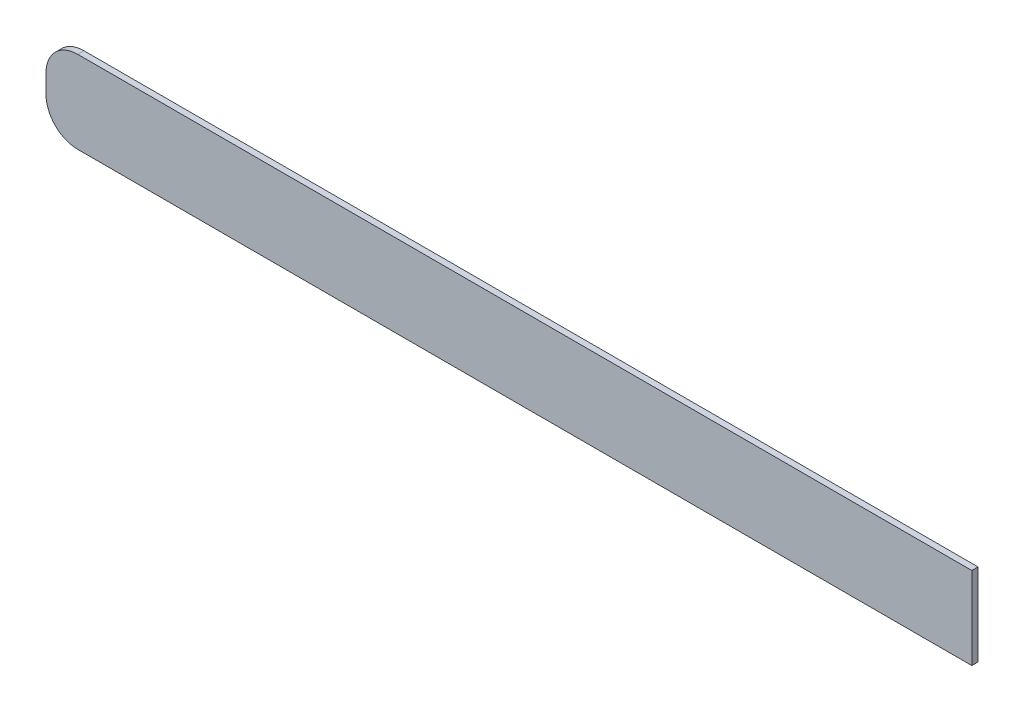
ISO-10303-21;
HEADER;
FILE_DESCRIPTION(('STEP AP214'),'2;1');
FILE_NAME('part.step','',(''),(''),'','','');
FILE_SCHEMA(('AUTOMOTIVE_DESIGN { 1 0 10303 214 1 1 1 1 }'));
ENDSEC;
DATA;
#1=APPLICATION_CONTEXT('core data for automotive mechanical design processes');
#2=APPLICATION_PROTOCOL_DEFINITION('international standard','automotive_design',2000,#1);
#3=PRODUCT_CONTEXT('',#1,'mechanical');
#4=PRODUCT('Part','Part','',(#3));
#5=PRODUCT_RELATED_PRODUCT_CATEGORY('part','',(#4));
#6=PRODUCT_DEFINITION_FORMATION('','',#4);
#7=PRODUCT_DEFINITION_CONTEXT('part definition',#1,'design');
#8=PRODUCT_DEFINITION('design','',#6,#7);
#9=PRODUCT_DEFINITION_SHAPE('','',#8);
#10=(LENGTH_UNIT() NAMED_UNIT(*) SI_UNIT(.MILLI.,.METRE.));
#11=(NAMED_UNIT(*) PLANE_ANGLE_UNIT() SI_UNIT($,.RADIAN.));
#12=(NAMED_UNIT(*) SI_UNIT($,.STERADIAN.) SOLID_ANGLE_UNIT());
#13=UNCERTAINTY_MEASURE_WITH_UNIT(LENGTH_MEASURE(1.E-05),#10,'distance_accuracy_value','');
#14=(GEOMETRIC_REPRESENTATION_CONTEXT(3) GLOBAL_UNCERTAINTY_ASSIGNED_CONTEXT((#13)) GLOBAL_UNIT_ASSIGNED_CONTEXT((#10,
#11,#12)) REPRESENTATION_CONTEXT('',''));
#15=CARTESIAN_POINT('',(0.,0.,0.));
#16=DIRECTION('',(0.,0.,1.));
#17=DIRECTION('',(1.,0.,0.));
#18=AXIS2_PLACEMENT_3D('',#15,#16,#17);
#19=CARTESIAN_POINT('',(36.9824,-3.28929999999999,0.4953));
#20=DIRECTION('',(-1.,0.,0.));
#21=DIRECTION('',(0.,0.,1.));
#22=AXIS2_PLACEMENT_3D('',#19,#20,#21);
#23=PLANE('',#22);
#24=DIRECTION('',(0.,1.,0.));
#25=VECTOR('',#24,1.);
#26=CARTESIAN_POINT('',(36.9824,-3.28929999999999,0.));
#27=LINE('',#26,#25);
#28=CARTESIAN_POINT('',(36.9824,-3.28929999999999,0.));
#29=VERTEX_POINT('',#28);
#30=CARTESIAN_POINT('',(36.9824,3.28930000000001,0.));
#31=VERTEX_POINT('',#30);
#32=EDGE_CURVE('E117',#29,#31,#27,.T.);
#33=ORIENTED_EDGE('',*,*,#32,.T.);
#34=DIRECTION('',(0.,0.,-1.));
#35=VECTOR('',#34,1.);
#36=CARTESIAN_POINT('',(36.9824,3.28930000000001,0.4953));
#37=LINE('',#36,#35);
#38=CARTESIAN_POINT('',(36.9824,3.28930000000001,0.4953));
#39=VERTEX_POINT('',#38);
#40=EDGE_CURVE('E11',#39,#31,#37,.T.);
#41=ORIENTED_EDGE('',*,*,#40,.F.);
#42=DIRECTION('',(0.,1.,0.));
#43=VECTOR('',#42,1.);
#44=CARTESIAN_POINT('',(36.9824,-3.28929999999999,0.4953));
#45=LINE('',#44,#43);
#46=CARTESIAN_POINT('',(36.9824,-3.28929999999999,0.4953));
#47=VERTEX_POINT('',#46);
#48=EDGE_CURVE('E127',#47,#39,#45,.T.);
#49=ORIENTED_EDGE('',*,*,#48,.F.);
#50=DIRECTION('',(0.,0.,-1.));
#51=VECTOR('',#50,1.);
#52=CARTESIAN_POINT('',(36.9824,-3.28929999999999,0.4953));
#53=LINE('',#52,#51);
#54=EDGE_CURVE('E113',#47,#29,#53,.T.);
#55=ORIENTED_EDGE('',*,*,#54,.T.);
#56=EDGE_LOOP('',(#33,#41,#49,#55));
#57=FACE_BOUND('',#56,.T.);
#58=ADVANCED_FACE('F33',(#57),#23,.F.);
#59=CARTESIAN_POINT('',(36.9824,3.28930000000001,0.4953));
#60=DIRECTION('',(0.,-1.,0.));
#61=DIRECTION('',(1.,0.,0.));
#62=AXIS2_PLACEMENT_3D('',#59,#60,#61);
#63=PLANE('',#62);
#64=DIRECTION('',(-1.,0.,0.));
#65=VECTOR('',#64,1.);
#66=CARTESIAN_POINT('',(36.9824,3.28930000000001,0.));
#67=LINE('',#66,#65);
#68=CARTESIAN_POINT('',(-34.4424,3.2893,0.));
#69=VERTEX_POINT('',#68);
#70=EDGE_CURVE('E120',#31,#69,#67,.T.);
#71=ORIENTED_EDGE('',*,*,#70,.T.);
#72=DIRECTION('',(0.,0.,-1.));
#73=VECTOR('',#72,1.);
#74=CARTESIAN_POINT('',(-34.4424,3.2893,0.4953));
#75=LINE('',#74,#73);
#76=CARTESIAN_POINT('',(-34.4424,3.2893,0.4953));
#77=VERTEX_POINT('',#76);
#78=EDGE_CURVE('E41',#77,#69,#75,.T.);
#79=ORIENTED_EDGE('',*,*,#78,.F.);
#80=DIRECTION('',(-1.,0.,0.));
#81=VECTOR('',#80,1.);
#82=CARTESIAN_POINT('',(36.9824,3.28930000000001,0.4953));
#83=LINE('',#82,#81);
#84=EDGE_CURVE('E86',#39,#77,#83,.T.);
#85=ORIENTED_EDGE('',*,*,#84,.F.);
#86=ORIENTED_EDGE('',*,*,#40,.T.);
#87=EDGE_LOOP('',(#71,#79,#85,#86));
#88=FACE_BOUND('',#87,.T.);
#89=ADVANCED_FACE('F151',(#88),#63,.F.);
#90=CARTESIAN_POINT('',(-34.4424000000001,0.749299999999999,0.4953));
#91=DIRECTION('',(0.,0.,-1.));
#92=DIRECTION('',(-1.,0.,0.));
#93=AXIS2_PLACEMENT_3D('',#90,#91,#92);
#94=CYLINDRICAL_SURFACE('',#93,2.54);
#95=CARTESIAN_POINT('',(-34.4424000000001,0.749299999999999,0.));
#96=DIRECTION('',(0.,0.,1.));
#97=DIRECTION('',(1.,0.,0.));
#98=AXIS2_PLACEMENT_3D('',#95,#96,#97);
#99=CIRCLE('',#98,2.54);
#100=CARTESIAN_POINT('',(-36.9824000000001,0.749299999999981,0.));
#101=VERTEX_POINT('',#100);
#102=EDGE_CURVE('E122',#69,#101,#99,.T.);
#103=ORIENTED_EDGE('',*,*,#102,.T.);
#104=DIRECTION('',(0.,0.,-1.));
#105=VECTOR('',#104,1.);
#106=CARTESIAN_POINT('',(-36.9824000000001,0.749299999999981,0.4953));
#107=LINE('',#106,#105);
#108=CARTESIAN_POINT('',(-36.9824000000001,0.749299999999981,0.4953));
#109=VERTEX_POINT('',#108);
#110=EDGE_CURVE('E108',#109,#101,#107,.T.);
#111=ORIENTED_EDGE('',*,*,#110,.F.);
#112=CARTESIAN_POINT('',(-34.4424000000001,0.749299999999999,0.4953));
#113=DIRECTION('',(0.,0.,1.));
#114=DIRECTION('',(1.,0.,0.));
#115=AXIS2_PLACEMENT_3D('',#112,#113,#114);
#116=CIRCLE('',#115,2.54);
#117=EDGE_CURVE('E99',#77,#109,#116,.T.);
#118=ORIENTED_EDGE('',*,*,#117,.F.);
#119=ORIENTED_EDGE('',*,*,#78,.T.);
#120=EDGE_LOOP('',(#103,#111,#118,#119));
#121=FACE_BOUND('',#120,.T.);
#122=ADVANCED_FACE('F133',(#121),#94,.T.);
#123=CARTESIAN_POINT('',(-36.9824000000001,-0.749299999999983,0.4953));
#124=DIRECTION('',(1.,0.,0.));
#125=DIRECTION('',(0.,0.,-1.));
#126=AXIS2_PLACEMENT_3D('',#123,#124,#125);
#127=PLANE('',#126);
#128=DIRECTION('',(0.,-1.,0.));
#129=VECTOR('',#128,1.);
#130=CARTESIAN_POINT('',(-36.9824000000001,-0.749299999999983,0.));
#131=LINE('',#130,#129);
#132=CARTESIAN_POINT('',(-36.9824000000001,-0.749299999999983,0.));
#133=VERTEX_POINT('',#132);
#134=EDGE_CURVE('E107',#101,#133,#131,.T.);
#135=ORIENTED_EDGE('',*,*,#134,.T.);
#136=DIRECTION('',(0.,0.,-1.));
#137=VECTOR('',#136,1.);
#138=CARTESIAN_POINT('',(-36.9824000000001,-0.749299999999983,0.4953));
#139=LINE('',#138,#137);
#140=CARTESIAN_POINT('',(-36.9824000000001,-0.749299999999983,0.4953));
#141=VERTEX_POINT('',#140);
#142=EDGE_CURVE('E104',#141,#133,#139,.T.);
#143=ORIENTED_EDGE('',*,*,#142,.F.);
#144=DIRECTION('',(0.,-1.,0.));
#145=VECTOR('',#144,1.);
#146=CARTESIAN_POINT('',(-36.9824000000001,-0.749299999999983,0.4953));
#147=LINE('',#146,#145);
#148=EDGE_CURVE('E93',#109,#141,#147,.T.);
#149=ORIENTED_EDGE('',*,*,#148,.F.);
#150=ORIENTED_EDGE('',*,*,#110,.T.);
#151=EDGE_LOOP('',(#135,#143,#149,#150));
#152=FACE_BOUND('',#151,.T.);
#153=ADVANCED_FACE('F105',(#152),#127,.F.);
#154=CARTESIAN_POINT('',(-34.4424000000001,-0.749300000000001,0.4953));
#155=DIRECTION('',(0.,0.,-1.));
#156=DIRECTION('',(-1.,0.,0.));
#157=AXIS2_PLACEMENT_3D('',#154,#155,#156);
#158=CYLINDRICAL_SURFACE('',#157,2.54);
#159=CARTESIAN_POINT('',(-34.4424000000001,-0.749300000000001,0.));
#160=DIRECTION('',(0.,0.,1.));
#161=DIRECTION('',(-1.,0.,0.));
#162=AXIS2_PLACEMENT_3D('',#159,#160,#161);
#163=CIRCLE('',#162,2.54);
#164=CARTESIAN_POINT('',(-34.4424,-3.2893,0.));
#165=VERTEX_POINT('',#164);
#166=EDGE_CURVE('E72',#133,#165,#163,.T.);
#167=ORIENTED_EDGE('',*,*,#166,.T.);
#168=DIRECTION('',(0.,0.,-1.));
#169=VECTOR('',#168,1.);
#170=CARTESIAN_POINT('',(-34.4424,-3.2893,0.4953));
#171=LINE('',#170,#169);
#172=CARTESIAN_POINT('',(-34.4424,-3.2893,0.4953));
#173=VERTEX_POINT('',#172);
#174=EDGE_CURVE('E109',#173,#165,#171,.T.);
#175=ORIENTED_EDGE('',*,*,#174,.F.);
#176=CARTESIAN_POINT('',(-34.4424000000001,-0.749300000000001,0.4953));
#177=DIRECTION('',(0.,0.,1.));
#178=DIRECTION('',(-1.,0.,0.));
#179=AXIS2_PLACEMENT_3D('',#176,#177,#178);
#180=CIRCLE('',#179,2.54);
#181=EDGE_CURVE('E97',#141,#173,#180,.T.);
#182=ORIENTED_EDGE('',*,*,#181,.F.);
#183=ORIENTED_EDGE('',*,*,#142,.T.);
#184=EDGE_LOOP('',(#167,#175,#182,#183));
#185=FACE_BOUND('',#184,.T.);
#186=ADVANCED_FACE('F111',(#185),#158,.T.);
#187=CARTESIAN_POINT('',(36.9824,-3.28929999999999,0.4953));
#188=DIRECTION('',(0.,1.,0.));
#189=DIRECTION('',(-1.,0.,0.));
#190=AXIS2_PLACEMENT_3D('',#187,#188,#189);
#191=PLANE('',#190);
#192=DIRECTION('',(1.,0.,0.));
#193=VECTOR('',#192,1.);
#194=CARTESIAN_POINT('',(36.9824,-3.28929999999999,0.));
#195=LINE('',#194,#193);
#196=EDGE_CURVE('E78',#165,#29,#195,.T.);
#197=ORIENTED_EDGE('',*,*,#196,.T.);
#198=ORIENTED_EDGE('',*,*,#54,.F.);
#199=DIRECTION('',(1.,0.,0.));
#200=VECTOR('',#199,1.);
#201=CARTESIAN_POINT('',(36.9824,-3.28929999999999,0.4953));
#202=LINE('',#201,#200);
#203=EDGE_CURVE('E49',#173,#47,#202,.T.);
#204=ORIENTED_EDGE('',*,*,#203,.F.);
#205=ORIENTED_EDGE('',*,*,#174,.T.);
#206=EDGE_LOOP('',(#197,#198,#204,#205));
#207=FACE_BOUND('',#206,.T.);
#208=ADVANCED_FACE('F140',(#207),#191,.F.);
#209=CARTESIAN_POINT('',(-34.4424000000001,0.749299999999999,0.4953));
#210=DIRECTION('',(0.,0.,1.));
#211=DIRECTION('',(1.,0.,0.));
#212=AXIS2_PLACEMENT_3D('',#209,#210,#211);
#213=PLANE('',#212);
#214=ORIENTED_EDGE('',*,*,#48,.T.);
#215=ORIENTED_EDGE('',*,*,#84,.T.);
#216=ORIENTED_EDGE('',*,*,#117,.T.);
#217=ORIENTED_EDGE('',*,*,#148,.T.);
#218=ORIENTED_EDGE('',*,*,#181,.T.);
#219=ORIENTED_EDGE('',*,*,#203,.T.);
#220=EDGE_LOOP('',(#214,#215,#216,#217,#218,#219));
#221=FACE_BOUND('',#220,.T.);
#222=ADVANCED_FACE('F95',(#221),#213,.T.);
#223=CARTESIAN_POINT('',(-34.4424000000001,0.749299999999999,0.));
#224=DIRECTION('',(0.,0.,1.));
#225=DIRECTION('',(1.,0.,0.));
#226=AXIS2_PLACEMENT_3D('',#223,#224,#225);
#227=PLANE('',#226);
#228=ORIENTED_EDGE('',*,*,#32,.F.);
#229=ORIENTED_EDGE('',*,*,#196,.F.);
#230=ORIENTED_EDGE('',*,*,#166,.F.);
#231=ORIENTED_EDGE('',*,*,#134,.F.);
#232=ORIENTED_EDGE('',*,*,#102,.F.);
#233=ORIENTED_EDGE('',*,*,#70,.F.);
#234=EDGE_LOOP('',(#228,#229,#230,#231,#232,#233));
#235=FACE_BOUND('',#234,.T.);
#236=ADVANCED_FACE('F136',(#235),#227,.F.);
#237=CLOSED_SHELL('',(#58,#89,#122,#153,#186,#208,#222,#236));
#238=MANIFOLD_SOLID_BREP('B2',#237);
#239=ADVANCED_BREP_SHAPE_REPRESENTATION('',(#18,#238),#14);
#240=SHAPE_DEFINITION_REPRESENTATION(#9,#239);
ENDSEC;
END-ISO-10303-21;
